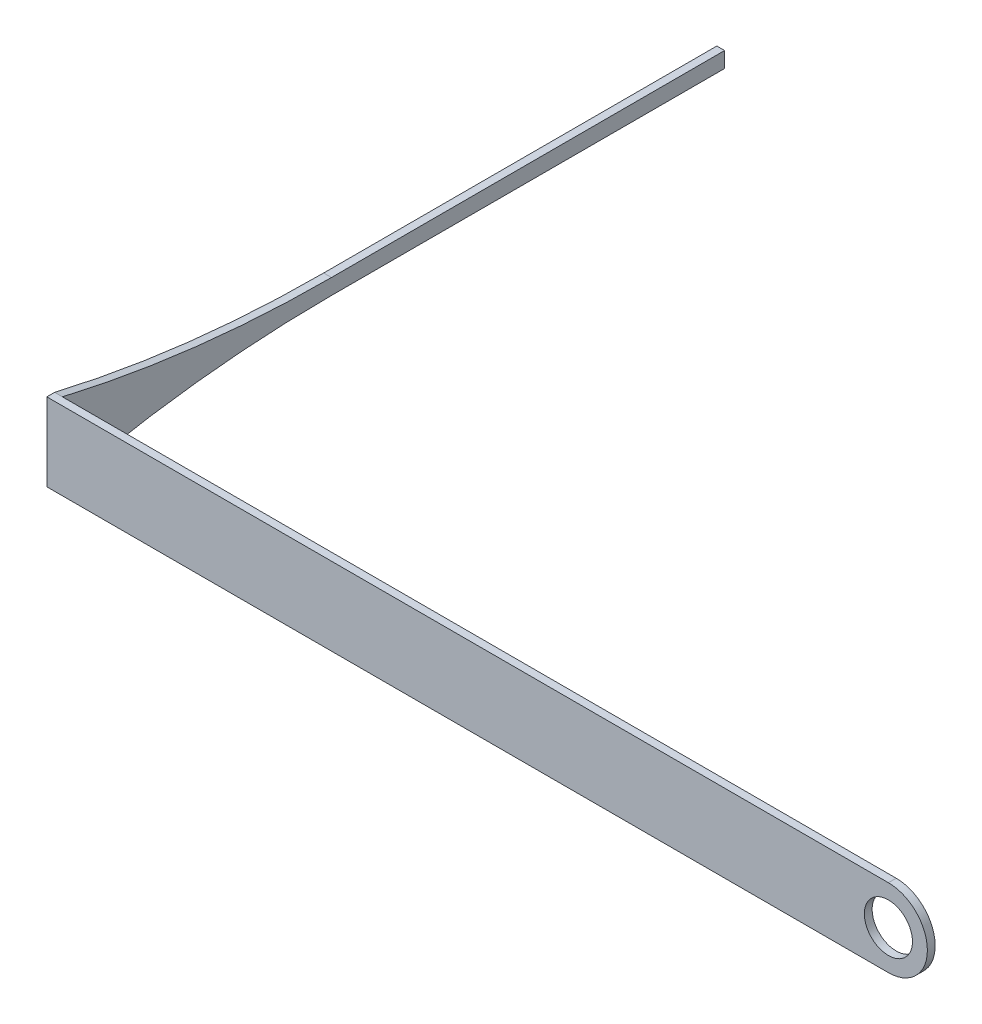
ISO-10303-21;
HEADER;
FILE_DESCRIPTION(('STEP AP214'),'2;1');
FILE_NAME('part.step','',(''),(''),'','','');
FILE_SCHEMA(('AUTOMOTIVE_DESIGN { 1 0 10303 214 1 1 1 1 }'));
ENDSEC;
DATA;
#1=APPLICATION_CONTEXT('core data for automotive mechanical design processes');
#2=APPLICATION_PROTOCOL_DEFINITION('international standard','automotive_design',2000,#1);
#3=PRODUCT_CONTEXT('',#1,'mechanical');
#4=PRODUCT('Part','Part','',(#3));
#5=PRODUCT_RELATED_PRODUCT_CATEGORY('part','',(#4));
#6=PRODUCT_DEFINITION_FORMATION('','',#4);
#7=PRODUCT_DEFINITION_CONTEXT('part definition',#1,'design');
#8=PRODUCT_DEFINITION('design','',#6,#7);
#9=PRODUCT_DEFINITION_SHAPE('','',#8);
#10=(LENGTH_UNIT() NAMED_UNIT(*) SI_UNIT(.MILLI.,.METRE.));
#11=(NAMED_UNIT(*) PLANE_ANGLE_UNIT() SI_UNIT($,.RADIAN.));
#12=(NAMED_UNIT(*) SI_UNIT($,.STERADIAN.) SOLID_ANGLE_UNIT());
#13=UNCERTAINTY_MEASURE_WITH_UNIT(LENGTH_MEASURE(1.E-05),#10,'distance_accuracy_value','');
#14=(GEOMETRIC_REPRESENTATION_CONTEXT(3) GLOBAL_UNCERTAINTY_ASSIGNED_CONTEXT((#13)) GLOBAL_UNIT_ASSIGNED_CONTEXT((#10,
#11,#12)) REPRESENTATION_CONTEXT('',''));
#15=CARTESIAN_POINT('',(0.,0.,0.));
#16=DIRECTION('',(0.,0.,1.));
#17=DIRECTION('',(1.,0.,0.));
#18=AXIS2_PLACEMENT_3D('',#15,#16,#17);
#19=CARTESIAN_POINT('',(-107.,5.,0.));
#20=DIRECTION('',(-1.,0.,0.));
#21=DIRECTION('',(0.,0.,1.));
#22=AXIS2_PLACEMENT_3D('',#19,#20,#21);
#23=PLANE('',#22);
#24=CARTESIAN_POINT('',(-107.,-152.017909025866,-34.527427824947));
#25=DIRECTION('',(-1.,0.,0.));
#26=DIRECTION('',(0.,0.,1.));
#27=AXIS2_PLACEMENT_3D('',#24,#25,#26);
#28=CIRCLE('',#27,151.017909025866);
#29=CARTESIAN_POINT('',(-107.,-1.,-34.527427824947));
#30=VERTEX_POINT('',#29);
#31=CARTESIAN_POINT('',(-107.,-5.,0.));
#32=VERTEX_POINT('',#31);
#33=EDGE_CURVE('E81',#30,#32,#28,.F.);
#34=ORIENTED_EDGE('',*,*,#33,.F.);
#35=DIRECTION('',(0.,0.,1.));
#36=VECTOR('',#35,1.);
#37=CARTESIAN_POINT('',(-107.,-1.,0.));
#38=LINE('',#37,#36);
#39=CARTESIAN_POINT('',(-107.,-1.,-84.9819117747085));
#40=VERTEX_POINT('',#39);
#41=EDGE_CURVE('E132',#40,#30,#38,.T.);
#42=ORIENTED_EDGE('',*,*,#41,.F.);
#43=DIRECTION('',(0.,-1.,0.));
#44=VECTOR('',#43,1.);
#45=CARTESIAN_POINT('',(-107.,5.,-84.9819117747085));
#46=LINE('',#45,#44);
#47=CARTESIAN_POINT('',(-107.,1.,-84.9819117747085));
#48=VERTEX_POINT('',#47);
#49=EDGE_CURVE('E117',#48,#40,#46,.T.);
#50=ORIENTED_EDGE('',*,*,#49,.F.);
#51=DIRECTION('',(0.,0.,-1.));
#52=VECTOR('',#51,1.);
#53=CARTESIAN_POINT('',(-107.,1.,0.));
#54=LINE('',#53,#52);
#55=CARTESIAN_POINT('',(-107.,1.,-34.527427824947));
#56=VERTEX_POINT('',#55);
#57=EDGE_CURVE('E124',#56,#48,#54,.T.);
#58=ORIENTED_EDGE('',*,*,#57,.F.);
#59=CARTESIAN_POINT('',(-107.,152.017909025866,-34.527427824947));
#60=DIRECTION('',(-1.,0.,0.));
#61=DIRECTION('',(0.,0.,1.));
#62=AXIS2_PLACEMENT_3D('',#59,#60,#61);
#63=CIRCLE('',#62,151.017909025866);
#64=CARTESIAN_POINT('',(-107.,5.,0.));
#65=VERTEX_POINT('',#64);
#66=EDGE_CURVE('E122',#56,#65,#63,.T.);
#67=ORIENTED_EDGE('',*,*,#66,.T.);
#68=DIRECTION('',(0.,-1.,0.));
#69=VECTOR('',#68,1.);
#70=CARTESIAN_POINT('',(-107.,5.,0.));
#71=LINE('',#70,#69);
#72=EDGE_CURVE('E87',#65,#32,#71,.T.);
#73=ORIENTED_EDGE('',*,*,#72,.T.);
#74=EDGE_LOOP('',(#34,#42,#50,#58,#67,#73));
#75=FACE_BOUND('',#74,.T.);
#76=ADVANCED_FACE('F35',(#75),#23,.F.);
#77=CARTESIAN_POINT('',(-108.,5.,-84.9819117747085));
#78=DIRECTION('',(0.,0.,1.));
#79=DIRECTION('',(1.,0.,0.));
#80=AXIS2_PLACEMENT_3D('',#77,#78,#79);
#81=PLANE('',#80);
#82=DIRECTION('',(-1.,0.,0.));
#83=VECTOR('',#82,1.);
#84=CARTESIAN_POINT('',(-98.,-1.,-84.9819117747085));
#85=LINE('',#84,#83);
#86=CARTESIAN_POINT('',(-108.,-1.,-84.9819117747085));
#87=VERTEX_POINT('',#86);
#88=EDGE_CURVE('E187',#40,#87,#85,.T.);
#89=ORIENTED_EDGE('',*,*,#88,.T.);
#90=DIRECTION('',(0.,-1.,0.));
#91=VECTOR('',#90,1.);
#92=CARTESIAN_POINT('',(-108.,5.,-84.9819117747085));
#93=LINE('',#92,#91);
#94=CARTESIAN_POINT('',(-108.,1.,-84.9819117747085));
#95=VERTEX_POINT('',#94);
#96=EDGE_CURVE('E114',#95,#87,#93,.T.);
#97=ORIENTED_EDGE('',*,*,#96,.F.);
#98=DIRECTION('',(1.,0.,0.));
#99=VECTOR('',#98,1.);
#100=CARTESIAN_POINT('',(-108.000012,1.,-84.9819117747085));
#101=LINE('',#100,#99);
#102=EDGE_CURVE('E97',#95,#48,#101,.T.);
#103=ORIENTED_EDGE('',*,*,#102,.T.);
#104=ORIENTED_EDGE('',*,*,#49,.T.);
#105=EDGE_LOOP('',(#89,#97,#103,#104));
#106=FACE_BOUND('',#105,.T.);
#107=ADVANCED_FACE('F198',(#106),#81,.F.);
#108=CARTESIAN_POINT('',(-108.,5.,1.00000000000001));
#109=DIRECTION('',(1.,0.,0.));
#110=DIRECTION('',(0.,0.,-1.));
#111=AXIS2_PLACEMENT_3D('',#108,#109,#110);
#112=PLANE('',#111);
#113=CARTESIAN_POINT('',(-108.,-152.017909025866,-34.527427824947));
#114=DIRECTION('',(-1.,0.,0.));
#115=DIRECTION('',(0.,0.,1.));
#116=AXIS2_PLACEMENT_3D('',#113,#114,#115);
#117=CIRCLE('',#116,151.017909025866);
#118=CARTESIAN_POINT('',(-108.,-1.,-34.527427824947));
#119=VERTEX_POINT('',#118);
#120=CARTESIAN_POINT('',(-108.,-5.,0.));
#121=VERTEX_POINT('',#120);
#122=EDGE_CURVE('E39',#119,#121,#117,.F.);
#123=ORIENTED_EDGE('',*,*,#122,.T.);
#124=DIRECTION('',(0.,0.,1.));
#125=VECTOR('',#124,1.);
#126=CARTESIAN_POINT('',(-108.,-5.,1.00000000000001));
#127=LINE('',#126,#125);
#128=CARTESIAN_POINT('',(-108.,-5.,1.00000000000001));
#129=VERTEX_POINT('',#128);
#130=EDGE_CURVE('E94',#121,#129,#127,.T.);
#131=ORIENTED_EDGE('',*,*,#130,.T.);
#132=DIRECTION('',(0.,-1.,0.));
#133=VECTOR('',#132,1.);
#134=CARTESIAN_POINT('',(-108.,5.,1.00000000000001));
#135=LINE('',#134,#133);
#136=CARTESIAN_POINT('',(-108.,5.,1.00000000000001));
#137=VERTEX_POINT('',#136);
#138=EDGE_CURVE('E112',#137,#129,#135,.T.);
#139=ORIENTED_EDGE('',*,*,#138,.F.);
#140=DIRECTION('',(0.,0.,1.));
#141=VECTOR('',#140,1.);
#142=CARTESIAN_POINT('',(-108.,5.,1.00000000000001));
#143=LINE('',#142,#141);
#144=CARTESIAN_POINT('',(-108.,5.,0.));
#145=VERTEX_POINT('',#144);
#146=EDGE_CURVE('E151',#145,#137,#143,.T.);
#147=ORIENTED_EDGE('',*,*,#146,.F.);
#148=CARTESIAN_POINT('',(-108.,152.017909025866,-34.527427824947));
#149=DIRECTION('',(-1.,0.,0.));
#150=DIRECTION('',(0.,0.,1.));
#151=AXIS2_PLACEMENT_3D('',#148,#149,#150);
#152=CIRCLE('',#151,151.017909025866);
#153=CARTESIAN_POINT('',(-108.,1.,-34.527427824947));
#154=VERTEX_POINT('',#153);
#155=EDGE_CURVE('E54',#154,#145,#152,.T.);
#156=ORIENTED_EDGE('',*,*,#155,.F.);
#157=DIRECTION('',(0.,0.,1.));
#158=VECTOR('',#157,1.);
#159=CARTESIAN_POINT('',(-108.,1.,1.00000000000001));
#160=LINE('',#159,#158);
#161=EDGE_CURVE('E45',#95,#154,#160,.T.);
#162=ORIENTED_EDGE('',*,*,#161,.F.);
#163=ORIENTED_EDGE('',*,*,#96,.T.);
#164=DIRECTION('',(0.,0.,-1.));
#165=VECTOR('',#164,1.);
#166=CARTESIAN_POINT('',(-108.,-1.,1.00000000000001));
#167=LINE('',#166,#165);
#168=EDGE_CURVE('E11',#119,#87,#167,.T.);
#169=ORIENTED_EDGE('',*,*,#168,.F.);
#170=EDGE_LOOP('',(#123,#131,#139,#147,#156,#162,#163,#169));
#171=FACE_BOUND('',#170,.T.);
#172=ADVANCED_FACE('F91',(#171),#112,.F.);
#173=CARTESIAN_POINT('',(0.,-5.,0.));
#174=DIRECTION('',(0.,-1.,0.));
#175=DIRECTION('',(0.,0.,-1.));
#176=AXIS2_PLACEMENT_3D('',#173,#174,#175);
#177=PLANE('',#176);
#178=ORIENTED_EDGE('',*,*,#130,.F.);
#179=DIRECTION('',(-1.,0.,0.));
#180=VECTOR('',#179,1.);
#181=CARTESIAN_POINT('',(-98.,-5.,0.));
#182=LINE('',#181,#180);
#183=EDGE_CURVE('E75',#121,#32,#182,.F.);
#184=ORIENTED_EDGE('',*,*,#183,.T.);
#185=DIRECTION('',(-1.,0.,0.));
#186=VECTOR('',#185,1.);
#187=CARTESIAN_POINT('',(0.,-5.,0.));
#188=LINE('',#187,#186);
#189=CARTESIAN_POINT('',(0.,-5.,0.));
#190=VERTEX_POINT('',#189);
#191=EDGE_CURVE('E103',#190,#32,#188,.T.);
#192=ORIENTED_EDGE('',*,*,#191,.F.);
#193=DIRECTION('',(0.,0.,-1.));
#194=VECTOR('',#193,1.);
#195=CARTESIAN_POINT('',(0.,-5.,0.));
#196=LINE('',#195,#194);
#197=CARTESIAN_POINT('',(0.,-5.,1.));
#198=VERTEX_POINT('',#197);
#199=EDGE_CURVE('E108',#198,#190,#196,.T.);
#200=ORIENTED_EDGE('',*,*,#199,.F.);
#201=DIRECTION('',(1.,0.,0.));
#202=VECTOR('',#201,1.);
#203=CARTESIAN_POINT('',(0.,-5.,1.));
#204=LINE('',#203,#202);
#205=EDGE_CURVE('E102',#129,#198,#204,.T.);
#206=ORIENTED_EDGE('',*,*,#205,.F.);
#207=EDGE_LOOP('',(#178,#184,#192,#200,#206));
#208=FACE_BOUND('',#207,.T.);
#209=ADVANCED_FACE('F99',(#208),#177,.T.);
#210=CARTESIAN_POINT('',(0.,5.,0.));
#211=DIRECTION('',(0.,0.,1.));
#212=DIRECTION('',(1.,0.,0.));
#213=AXIS2_PLACEMENT_3D('',#210,#211,#212);
#214=PLANE('',#213);
#215=CARTESIAN_POINT('',(0.,0.,0.));
#216=DIRECTION('',(0.,0.,1.));
#217=DIRECTION('',(1.,0.,0.));
#218=AXIS2_PLACEMENT_3D('',#215,#216,#217);
#219=CIRCLE('',#218,5.);
#220=CARTESIAN_POINT('',(0.,5.,0.));
#221=VERTEX_POINT('',#220);
#222=EDGE_CURVE('E138',#221,#190,#219,.F.);
#223=ORIENTED_EDGE('',*,*,#222,.T.);
#224=ORIENTED_EDGE('',*,*,#191,.T.);
#225=ORIENTED_EDGE('',*,*,#72,.F.);
#226=DIRECTION('',(-1.,0.,0.));
#227=VECTOR('',#226,1.);
#228=CARTESIAN_POINT('',(0.,5.,0.));
#229=LINE('',#228,#227);
#230=EDGE_CURVE('E148',#221,#65,#229,.T.);
#231=ORIENTED_EDGE('',*,*,#230,.F.);
#232=EDGE_LOOP('',(#223,#224,#225,#231));
#233=FACE_BOUND('',#232,.T.);
#234=CARTESIAN_POINT('',(0.,0.,0.));
#235=DIRECTION('',(0.,0.,1.));
#236=DIRECTION('',(1.,0.,0.));
#237=AXIS2_PLACEMENT_3D('',#234,#235,#236);
#238=CIRCLE('',#237,3.08891323509562);
#239=CARTESIAN_POINT('',(3.08891323509562,0.,0.));
#240=VERTEX_POINT('',#239);
#241=EDGE_CURVE('E135',#240,#240,#238,.F.);
#242=ORIENTED_EDGE('',*,*,#241,.F.);
#243=EDGE_LOOP('',(#242));
#244=FACE_BOUND('',#243,.T.);
#245=ADVANCED_FACE('F37',(#233,#244),#214,.F.);
#246=CARTESIAN_POINT('',(0.,5.,1.));
#247=DIRECTION('',(0.,0.,-1.));
#248=DIRECTION('',(-1.,0.,0.));
#249=AXIS2_PLACEMENT_3D('',#246,#247,#248);
#250=PLANE('',#249);
#251=CARTESIAN_POINT('',(0.,0.,1.));
#252=DIRECTION('',(0.,0.,1.));
#253=DIRECTION('',(1.,0.,0.));
#254=AXIS2_PLACEMENT_3D('',#251,#252,#253);
#255=CIRCLE('',#254,3.08891323509562);
#256=CARTESIAN_POINT('',(3.08891323509562,0.,1.));
#257=VERTEX_POINT('',#256);
#258=EDGE_CURVE('E139',#257,#257,#255,.T.);
#259=ORIENTED_EDGE('',*,*,#258,.F.);
#260=EDGE_LOOP('',(#259));
#261=FACE_BOUND('',#260,.T.);
#262=ORIENTED_EDGE('',*,*,#205,.T.);
#263=CARTESIAN_POINT('',(0.,0.,1.));
#264=DIRECTION('',(0.,0.,1.));
#265=DIRECTION('',(1.,0.,0.));
#266=AXIS2_PLACEMENT_3D('',#263,#264,#265);
#267=CIRCLE('',#266,5.);
#268=CARTESIAN_POINT('',(0.,5.,1.));
#269=VERTEX_POINT('',#268);
#270=EDGE_CURVE('E134',#198,#269,#267,.T.);
#271=ORIENTED_EDGE('',*,*,#270,.T.);
#272=DIRECTION('',(1.,0.,0.));
#273=VECTOR('',#272,1.);
#274=CARTESIAN_POINT('',(0.,5.,1.));
#275=LINE('',#274,#273);
#276=EDGE_CURVE('E115',#137,#269,#275,.T.);
#277=ORIENTED_EDGE('',*,*,#276,.F.);
#278=ORIENTED_EDGE('',*,*,#138,.T.);
#279=EDGE_LOOP('',(#262,#271,#277,#278));
#280=FACE_BOUND('',#279,.T.);
#281=ADVANCED_FACE('F211',(#261,#280),#250,.F.);
#282=CARTESIAN_POINT('',(0.,5.,0.));
#283=DIRECTION('',(0.,-1.,0.));
#284=DIRECTION('',(0.,0.,-1.));
#285=AXIS2_PLACEMENT_3D('',#282,#283,#284);
#286=PLANE('',#285);
#287=ORIENTED_EDGE('',*,*,#230,.T.);
#288=DIRECTION('',(-1.,0.,0.));
#289=VECTOR('',#288,1.);
#290=CARTESIAN_POINT('',(-98.,5.,0.));
#291=LINE('',#290,#289);
#292=EDGE_CURVE('E86',#65,#145,#291,.T.);
#293=ORIENTED_EDGE('',*,*,#292,.T.);
#294=ORIENTED_EDGE('',*,*,#146,.T.);
#295=ORIENTED_EDGE('',*,*,#276,.T.);
#296=DIRECTION('',(0.,0.,-1.));
#297=VECTOR('',#296,1.);
#298=CARTESIAN_POINT('',(0.,5.,0.));
#299=LINE('',#298,#297);
#300=EDGE_CURVE('E105',#269,#221,#299,.T.);
#301=ORIENTED_EDGE('',*,*,#300,.T.);
#302=EDGE_LOOP('',(#287,#293,#294,#295,#301));
#303=FACE_BOUND('',#302,.T.);
#304=ADVANCED_FACE('F207',(#303),#286,.F.);
#305=CARTESIAN_POINT('',(0.,0.,-11.1803398874989));
#306=DIRECTION('',(0.,0.,1.));
#307=DIRECTION('',(1.,0.,0.));
#308=AXIS2_PLACEMENT_3D('',#305,#306,#307);
#309=CYLINDRICAL_SURFACE('',#308,3.08891323509562);
#310=ORIENTED_EDGE('',*,*,#258,.T.);
#311=EDGE_LOOP('',(#310));
#312=FACE_BOUND('',#311,.T.);
#313=ORIENTED_EDGE('',*,*,#241,.T.);
#314=EDGE_LOOP('',(#313));
#315=FACE_BOUND('',#314,.T.);
#316=ADVANCED_FACE('F219',(#312,#315),#309,.F.);
#317=CARTESIAN_POINT('',(0.,0.,-11.1803398874989));
#318=DIRECTION('',(0.,0.,1.));
#319=DIRECTION('',(1.,0.,0.));
#320=AXIS2_PLACEMENT_3D('',#317,#318,#319);
#321=CYLINDRICAL_SURFACE('',#320,5.);
#322=ORIENTED_EDGE('',*,*,#222,.F.);
#323=ORIENTED_EDGE('',*,*,#300,.F.);
#324=ORIENTED_EDGE('',*,*,#270,.F.);
#325=ORIENTED_EDGE('',*,*,#199,.T.);
#326=EDGE_LOOP('',(#322,#323,#324,#325));
#327=FACE_BOUND('',#326,.T.);
#328=ADVANCED_FACE('F159',(#327),#321,.T.);
#329=CARTESIAN_POINT('',(-98.,-1.,0.));
#330=DIRECTION('',(0.,-1.,0.));
#331=DIRECTION('',(0.,0.,-1.));
#332=AXIS2_PLACEMENT_3D('',#329,#330,#331);
#333=PLANE('',#332);
#334=ORIENTED_EDGE('',*,*,#41,.T.);
#335=DIRECTION('',(-1.,0.,0.));
#336=VECTOR('',#335,1.);
#337=CARTESIAN_POINT('',(-98.,-1.,-34.527427824947));
#338=LINE('',#337,#336);
#339=EDGE_CURVE('E67',#30,#119,#338,.T.);
#340=ORIENTED_EDGE('',*,*,#339,.T.);
#341=ORIENTED_EDGE('',*,*,#168,.T.);
#342=ORIENTED_EDGE('',*,*,#88,.F.);
#343=EDGE_LOOP('',(#334,#340,#341,#342));
#344=FACE_BOUND('',#343,.T.);
#345=ADVANCED_FACE('F189',(#344),#333,.T.);
#346=CARTESIAN_POINT('',(-98.,-152.017909025866,-34.527427824947));
#347=DIRECTION('',(-1.,0.,0.));
#348=DIRECTION('',(0.,0.,1.));
#349=AXIS2_PLACEMENT_3D('',#346,#347,#348);
#350=CYLINDRICAL_SURFACE('',#349,151.017909025866);
#351=ORIENTED_EDGE('',*,*,#33,.T.);
#352=ORIENTED_EDGE('',*,*,#183,.F.);
#353=ORIENTED_EDGE('',*,*,#122,.F.);
#354=ORIENTED_EDGE('',*,*,#339,.F.);
#355=EDGE_LOOP('',(#351,#352,#353,#354));
#356=FACE_BOUND('',#355,.T.);
#357=ADVANCED_FACE('F77',(#356),#350,.F.);
#358=CARTESIAN_POINT('',(-108.000012,1.,0.));
#359=DIRECTION('',(0.,1.,0.));
#360=DIRECTION('',(0.,0.,1.));
#361=AXIS2_PLACEMENT_3D('',#358,#359,#360);
#362=PLANE('',#361);
#363=ORIENTED_EDGE('',*,*,#57,.T.);
#364=ORIENTED_EDGE('',*,*,#102,.F.);
#365=ORIENTED_EDGE('',*,*,#161,.T.);
#366=DIRECTION('',(-1.,0.,0.));
#367=VECTOR('',#366,1.);
#368=CARTESIAN_POINT('',(-98.,1.,-34.527427824947));
#369=LINE('',#368,#367);
#370=EDGE_CURVE('E192',#56,#154,#369,.T.);
#371=ORIENTED_EDGE('',*,*,#370,.F.);
#372=EDGE_LOOP('',(#363,#364,#365,#371));
#373=FACE_BOUND('',#372,.T.);
#374=ADVANCED_FACE('F241',(#373),#362,.T.);
#375=CARTESIAN_POINT('',(-98.,152.017909025866,-34.527427824947));
#376=DIRECTION('',(-1.,0.,0.));
#377=DIRECTION('',(0.,0.,1.));
#378=AXIS2_PLACEMENT_3D('',#375,#376,#377);
#379=CYLINDRICAL_SURFACE('',#378,151.017909025866);
#380=ORIENTED_EDGE('',*,*,#370,.T.);
#381=ORIENTED_EDGE('',*,*,#155,.T.);
#382=ORIENTED_EDGE('',*,*,#292,.F.);
#383=ORIENTED_EDGE('',*,*,#66,.F.);
#384=EDGE_LOOP('',(#380,#381,#382,#383));
#385=FACE_BOUND('',#384,.T.);
#386=ADVANCED_FACE('F203',(#385),#379,.F.);
#387=CLOSED_SHELL('',(#76,#107,#172,#209,#245,#281,#304,#316,#328,#345,#357,#374,#386));
#388=MANIFOLD_SOLID_BREP('B2',#387);
#389=ADVANCED_BREP_SHAPE_REPRESENTATION('',(#18,#388),#14);
#390=SHAPE_DEFINITION_REPRESENTATION(#9,#389);
ENDSEC;
END-ISO-10303-21;
